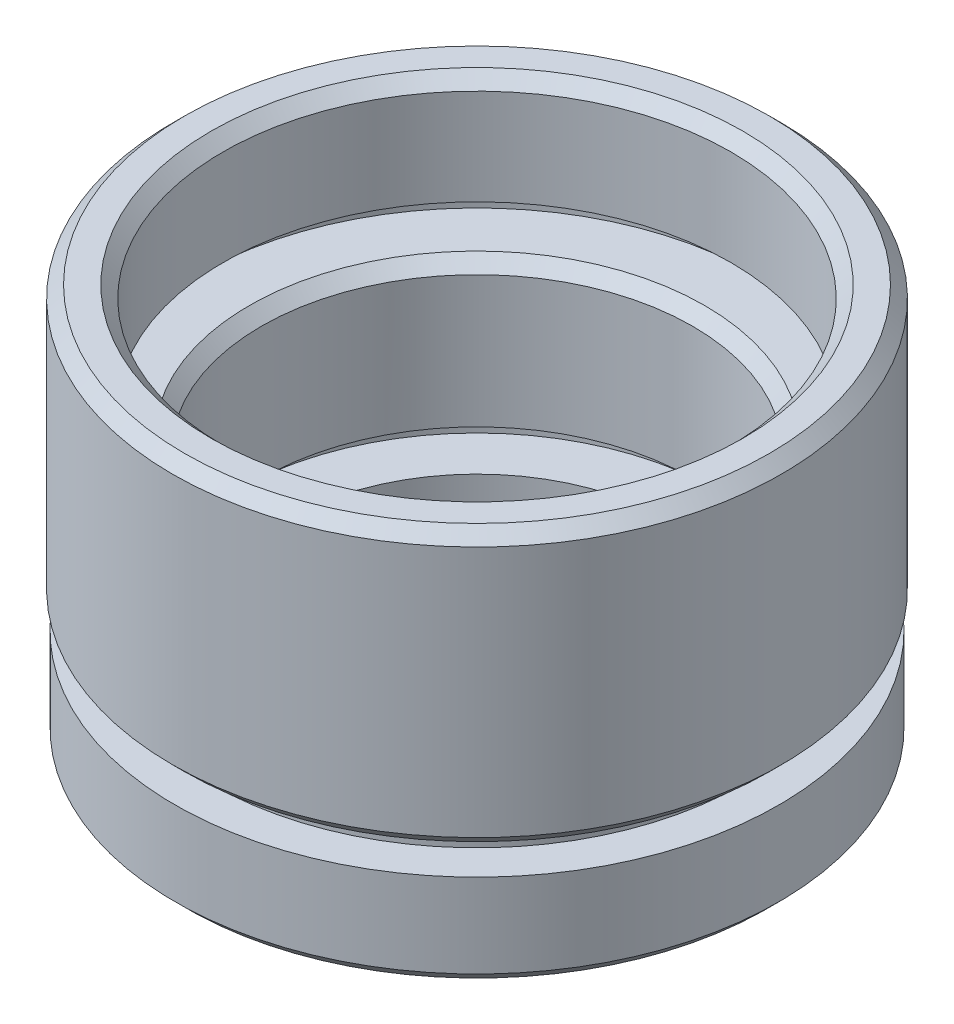
ISO-10303-21;
HEADER;
FILE_DESCRIPTION(('STEP AP214'),'2;1');
FILE_NAME('part.step','',(''),(''),'','','');
FILE_SCHEMA(('AUTOMOTIVE_DESIGN { 1 0 10303 214 1 1 1 1 }'));
ENDSEC;
DATA;
#1=APPLICATION_CONTEXT('core data for automotive mechanical design processes');
#2=APPLICATION_PROTOCOL_DEFINITION('international standard','automotive_design',2000,#1);
#3=PRODUCT_CONTEXT('',#1,'mechanical');
#4=PRODUCT('Part','Part','',(#3));
#5=PRODUCT_RELATED_PRODUCT_CATEGORY('part','',(#4));
#6=PRODUCT_DEFINITION_FORMATION('','',#4);
#7=PRODUCT_DEFINITION_CONTEXT('part definition',#1,'design');
#8=PRODUCT_DEFINITION('design','',#6,#7);
#9=PRODUCT_DEFINITION_SHAPE('','',#8);
#10=(LENGTH_UNIT() NAMED_UNIT(*) SI_UNIT(.MILLI.,.METRE.));
#11=(NAMED_UNIT(*) PLANE_ANGLE_UNIT() SI_UNIT($,.RADIAN.));
#12=(NAMED_UNIT(*) SI_UNIT($,.STERADIAN.) SOLID_ANGLE_UNIT());
#13=UNCERTAINTY_MEASURE_WITH_UNIT(LENGTH_MEASURE(1.E-05),#10,'distance_accuracy_value','');
#14=(GEOMETRIC_REPRESENTATION_CONTEXT(3) GLOBAL_UNCERTAINTY_ASSIGNED_CONTEXT((#13)) GLOBAL_UNIT_ASSIGNED_CONTEXT((#10,
#11,#12)) REPRESENTATION_CONTEXT('',''));
#15=CARTESIAN_POINT('',(0.,0.,0.));
#16=DIRECTION('',(0.,0.,1.));
#17=DIRECTION('',(1.,0.,0.));
#18=AXIS2_PLACEMENT_3D('',#15,#16,#17);
#19=CARTESIAN_POINT('',(10.6,16.5,0.));
#20=DIRECTION('',(0.,1.,0.));
#21=DIRECTION('',(0.,0.,1.));
#22=AXIS2_PLACEMENT_3D('',#19,#20,#21);
#23=PLANE('',#22);
#24=CARTESIAN_POINT('',(0.,16.5,0.));
#25=DIRECTION('',(0.,1.,0.));
#26=DIRECTION('',(0.,0.,1.));
#27=AXIS2_PLACEMENT_3D('',#24,#25,#26);
#28=CIRCLE('',#27,11.1);
#29=CARTESIAN_POINT('',(0.,16.5,11.1));
#30=VERTEX_POINT('',#29);
#31=EDGE_CURVE('E42',#30,#30,#28,.F.);
#32=ORIENTED_EDGE('',*,*,#31,.T.);
#33=EDGE_LOOP('',(#32));
#34=FACE_BOUND('',#33,.T.);
#35=CARTESIAN_POINT('',(0.,16.5,0.));
#36=DIRECTION('',(0.,-1.,0.));
#37=DIRECTION('',(0.,0.,-1.));
#38=AXIS2_PLACEMENT_3D('',#35,#36,#37);
#39=CIRCLE('',#38,12.2);
#40=CARTESIAN_POINT('',(0.,16.5,-12.2));
#41=VERTEX_POINT('',#40);
#42=EDGE_CURVE('E109',#41,#41,#39,.T.);
#43=ORIENTED_EDGE('',*,*,#42,.F.);
#44=EDGE_LOOP('',(#43));
#45=FACE_BOUND('',#44,.T.);
#46=ADVANCED_FACE('F35',(#34,#45),#23,.T.);
#47=CARTESIAN_POINT('',(0.,0.,0.));
#48=DIRECTION('',(0.,-1.,0.));
#49=DIRECTION('',(0.,0.,-1.));
#50=AXIS2_PLACEMENT_3D('',#47,#48,#49);
#51=CYLINDRICAL_SURFACE('',#50,10.6);
#52=CARTESIAN_POINT('',(0.,16.,0.));
#53=DIRECTION('',(0.,1.,0.));
#54=DIRECTION('',(0.,0.,1.));
#55=AXIS2_PLACEMENT_3D('',#52,#53,#54);
#56=CIRCLE('',#55,10.6);
#57=CARTESIAN_POINT('',(0.,16.,10.6));
#58=VERTEX_POINT('',#57);
#59=EDGE_CURVE('E10',#58,#58,#56,.T.);
#60=ORIENTED_EDGE('',*,*,#59,.T.);
#61=EDGE_LOOP('',(#60));
#62=FACE_BOUND('',#61,.T.);
#63=CARTESIAN_POINT('',(0.,12.,0.));
#64=DIRECTION('',(0.,-1.,0.));
#65=DIRECTION('',(0.,0.,-1.));
#66=AXIS2_PLACEMENT_3D('',#63,#64,#65);
#67=CIRCLE('',#66,10.6);
#68=CARTESIAN_POINT('',(0.,12.,-10.6));
#69=VERTEX_POINT('',#68);
#70=EDGE_CURVE('E55',#69,#69,#67,.T.);
#71=ORIENTED_EDGE('',*,*,#70,.T.);
#72=EDGE_LOOP('',(#71));
#73=FACE_BOUND('',#72,.T.);
#74=ADVANCED_FACE('F117',(#62,#73),#51,.F.);
#75=CARTESIAN_POINT('',(11.7,12.,0.));
#76=DIRECTION('',(0.,-1.,0.));
#77=DIRECTION('',(0.,0.,-1.));
#78=AXIS2_PLACEMENT_3D('',#75,#76,#77);
#79=PLANE('',#78);
#80=CARTESIAN_POINT('',(0.,12.,0.));
#81=DIRECTION('',(0.,-1.,0.));
#82=DIRECTION('',(0.,0.,-1.));
#83=AXIS2_PLACEMENT_3D('',#80,#81,#82);
#84=CIRCLE('',#83,11.7);
#85=CARTESIAN_POINT('',(0.,12.,-11.7));
#86=VERTEX_POINT('',#85);
#87=EDGE_CURVE('E58',#86,#86,#84,.T.);
#88=ORIENTED_EDGE('',*,*,#87,.T.);
#89=EDGE_LOOP('',(#88));
#90=FACE_BOUND('',#89,.T.);
#91=ORIENTED_EDGE('',*,*,#70,.F.);
#92=EDGE_LOOP('',(#91));
#93=FACE_BOUND('',#92,.T.);
#94=ADVANCED_FACE('F122',(#90,#93),#79,.T.);
#95=CARTESIAN_POINT('',(0.,0.,0.));
#96=DIRECTION('',(0.,-1.,0.));
#97=DIRECTION('',(0.,0.,-1.));
#98=AXIS2_PLACEMENT_3D('',#95,#96,#97);
#99=CYLINDRICAL_SURFACE('',#98,11.7);
#100=CARTESIAN_POINT('',(0.,11.,0.));
#101=DIRECTION('',(0.,-1.,0.));
#102=DIRECTION('',(0.,0.,-1.));
#103=AXIS2_PLACEMENT_3D('',#100,#101,#102);
#104=CIRCLE('',#103,11.7);
#105=CARTESIAN_POINT('',(0.,11.,-11.7));
#106=VERTEX_POINT('',#105);
#107=EDGE_CURVE('E61',#106,#106,#104,.T.);
#108=ORIENTED_EDGE('',*,*,#107,.T.);
#109=EDGE_LOOP('',(#108));
#110=FACE_BOUND('',#109,.T.);
#111=ORIENTED_EDGE('',*,*,#87,.F.);
#112=EDGE_LOOP('',(#111));
#113=FACE_BOUND('',#112,.T.);
#114=ADVANCED_FACE('F143',(#110,#113),#99,.F.);
#115=CARTESIAN_POINT('',(9.,11.,0.));
#116=DIRECTION('',(0.,1.,0.));
#117=DIRECTION('',(0.,0.,1.));
#118=AXIS2_PLACEMENT_3D('',#115,#116,#117);
#119=PLANE('',#118);
#120=CARTESIAN_POINT('',(0.,11.,0.));
#121=DIRECTION('',(0.,1.,0.));
#122=DIRECTION('',(0.,0.,1.));
#123=AXIS2_PLACEMENT_3D('',#120,#121,#122);
#124=CIRCLE('',#123,9.49999999999999);
#125=CARTESIAN_POINT('',(0.,11.,9.49999999999999));
#126=VERTEX_POINT('',#125);
#127=EDGE_CURVE('E50',#126,#126,#124,.F.);
#128=ORIENTED_EDGE('',*,*,#127,.T.);
#129=EDGE_LOOP('',(#128));
#130=FACE_BOUND('',#129,.T.);
#131=ORIENTED_EDGE('',*,*,#107,.F.);
#132=EDGE_LOOP('',(#131));
#133=FACE_BOUND('',#132,.T.);
#134=ADVANCED_FACE('F139',(#130,#133),#119,.T.);
#135=CARTESIAN_POINT('',(0.,0.,0.));
#136=DIRECTION('',(0.,-1.,0.));
#137=DIRECTION('',(0.,0.,-1.));
#138=AXIS2_PLACEMENT_3D('',#135,#136,#137);
#139=CYLINDRICAL_SURFACE('',#138,9.);
#140=CARTESIAN_POINT('',(0.,10.5,0.));
#141=DIRECTION('',(0.,1.,0.));
#142=DIRECTION('',(0.,0.,1.));
#143=AXIS2_PLACEMENT_3D('',#140,#141,#142);
#144=CIRCLE('',#143,9.);
#145=CARTESIAN_POINT('',(0.,10.5,9.));
#146=VERTEX_POINT('',#145);
#147=EDGE_CURVE('E46',#146,#146,#144,.T.);
#148=ORIENTED_EDGE('',*,*,#147,.T.);
#149=EDGE_LOOP('',(#148));
#150=FACE_BOUND('',#149,.T.);
#151=CARTESIAN_POINT('',(0.,5.,0.));
#152=DIRECTION('',(0.,-1.,0.));
#153=DIRECTION('',(0.,0.,-1.));
#154=AXIS2_PLACEMENT_3D('',#151,#152,#153);
#155=CIRCLE('',#154,9.);
#156=CARTESIAN_POINT('',(0.,5.,-9.));
#157=VERTEX_POINT('',#156);
#158=EDGE_CURVE('E64',#157,#157,#155,.T.);
#159=ORIENTED_EDGE('',*,*,#158,.T.);
#160=EDGE_LOOP('',(#159));
#161=FACE_BOUND('',#160,.T.);
#162=ADVANCED_FACE('F142',(#150,#161),#139,.F.);
#163=CARTESIAN_POINT('',(10.1,5.,0.));
#164=DIRECTION('',(0.,-1.,0.));
#165=DIRECTION('',(0.,0.,-1.));
#166=AXIS2_PLACEMENT_3D('',#163,#164,#165);
#167=PLANE('',#166);
#168=CARTESIAN_POINT('',(0.,5.,0.));
#169=DIRECTION('',(0.,-1.,0.));
#170=DIRECTION('',(0.,0.,-1.));
#171=AXIS2_PLACEMENT_3D('',#168,#169,#170);
#172=CIRCLE('',#171,10.1);
#173=CARTESIAN_POINT('',(0.,5.,-10.1));
#174=VERTEX_POINT('',#173);
#175=EDGE_CURVE('E67',#174,#174,#172,.T.);
#176=ORIENTED_EDGE('',*,*,#175,.T.);
#177=EDGE_LOOP('',(#176));
#178=FACE_BOUND('',#177,.T.);
#179=ORIENTED_EDGE('',*,*,#158,.F.);
#180=EDGE_LOOP('',(#179));
#181=FACE_BOUND('',#180,.T.);
#182=ADVANCED_FACE('F161',(#178,#181),#167,.T.);
#183=CARTESIAN_POINT('',(0.,0.,0.));
#184=DIRECTION('',(0.,-1.,0.));
#185=DIRECTION('',(0.,0.,-1.));
#186=AXIS2_PLACEMENT_3D('',#183,#184,#185);
#187=CYLINDRICAL_SURFACE('',#186,10.1);
#188=CARTESIAN_POINT('',(0.,4.,0.));
#189=DIRECTION('',(0.,-1.,0.));
#190=DIRECTION('',(0.,0.,-1.));
#191=AXIS2_PLACEMENT_3D('',#188,#189,#190);
#192=CIRCLE('',#191,10.1);
#193=CARTESIAN_POINT('',(0.,4.,-10.1));
#194=VERTEX_POINT('',#193);
#195=EDGE_CURVE('E70',#194,#194,#192,.T.);
#196=ORIENTED_EDGE('',*,*,#195,.T.);
#197=EDGE_LOOP('',(#196));
#198=FACE_BOUND('',#197,.T.);
#199=ORIENTED_EDGE('',*,*,#175,.F.);
#200=EDGE_LOOP('',(#199));
#201=FACE_BOUND('',#200,.T.);
#202=ADVANCED_FACE('F165',(#198,#201),#187,.F.);
#203=CARTESIAN_POINT('',(8.,4.,0.));
#204=DIRECTION('',(0.,1.,0.));
#205=DIRECTION('',(0.,0.,1.));
#206=AXIS2_PLACEMENT_3D('',#203,#204,#205);
#207=PLANE('',#206);
#208=CARTESIAN_POINT('',(0.,4.,0.));
#209=DIRECTION('',(0.,-1.,0.));
#210=DIRECTION('',(0.,0.,-1.));
#211=AXIS2_PLACEMENT_3D('',#208,#209,#210);
#212=CIRCLE('',#211,8.);
#213=CARTESIAN_POINT('',(0.,4.,-8.));
#214=VERTEX_POINT('',#213);
#215=EDGE_CURVE('E73',#214,#214,#212,.T.);
#216=ORIENTED_EDGE('',*,*,#215,.T.);
#217=EDGE_LOOP('',(#216));
#218=FACE_BOUND('',#217,.T.);
#219=ORIENTED_EDGE('',*,*,#195,.F.);
#220=EDGE_LOOP('',(#219));
#221=FACE_BOUND('',#220,.T.);
#222=ADVANCED_FACE('F169',(#218,#221),#207,.T.);
#223=CARTESIAN_POINT('',(0.,0.,0.));
#224=DIRECTION('',(0.,-1.,0.));
#225=DIRECTION('',(0.,0.,-1.));
#226=AXIS2_PLACEMENT_3D('',#223,#224,#225);
#227=CYLINDRICAL_SURFACE('',#226,8.);
#228=CARTESIAN_POINT('',(0.,2.,0.));
#229=DIRECTION('',(0.,-1.,0.));
#230=DIRECTION('',(0.,0.,-1.));
#231=AXIS2_PLACEMENT_3D('',#228,#229,#230);
#232=CIRCLE('',#231,8.);
#233=CARTESIAN_POINT('',(0.,2.,-8.));
#234=VERTEX_POINT('',#233);
#235=EDGE_CURVE('E76',#234,#234,#232,.T.);
#236=ORIENTED_EDGE('',*,*,#235,.T.);
#237=EDGE_LOOP('',(#236));
#238=FACE_BOUND('',#237,.T.);
#239=ORIENTED_EDGE('',*,*,#215,.F.);
#240=EDGE_LOOP('',(#239));
#241=FACE_BOUND('',#240,.T.);
#242=ADVANCED_FACE('F173',(#238,#241),#227,.F.);
#243=CARTESIAN_POINT('',(7.25,2.,0.));
#244=DIRECTION('',(0.,1.,0.));
#245=DIRECTION('',(0.,0.,1.));
#246=AXIS2_PLACEMENT_3D('',#243,#244,#245);
#247=PLANE('',#246);
#248=CARTESIAN_POINT('',(0.,2.,0.));
#249=DIRECTION('',(0.,-1.,0.));
#250=DIRECTION('',(0.,0.,-1.));
#251=AXIS2_PLACEMENT_3D('',#248,#249,#250);
#252=CIRCLE('',#251,7.25);
#253=CARTESIAN_POINT('',(0.,2.,-7.25));
#254=VERTEX_POINT('',#253);
#255=EDGE_CURVE('E79',#254,#254,#252,.T.);
#256=ORIENTED_EDGE('',*,*,#255,.T.);
#257=EDGE_LOOP('',(#256));
#258=FACE_BOUND('',#257,.T.);
#259=ORIENTED_EDGE('',*,*,#235,.F.);
#260=EDGE_LOOP('',(#259));
#261=FACE_BOUND('',#260,.T.);
#262=ADVANCED_FACE('F177',(#258,#261),#247,.T.);
#263=CARTESIAN_POINT('',(0.,0.,0.));
#264=DIRECTION('',(0.,-1.,0.));
#265=DIRECTION('',(0.,0.,-1.));
#266=AXIS2_PLACEMENT_3D('',#263,#264,#265);
#267=CYLINDRICAL_SURFACE('',#266,7.25);
#268=CARTESIAN_POINT('',(0.,0.,0.));
#269=DIRECTION('',(0.,-1.,0.));
#270=DIRECTION('',(0.,0.,-1.));
#271=AXIS2_PLACEMENT_3D('',#268,#269,#270);
#272=CIRCLE('',#271,7.25);
#273=CARTESIAN_POINT('',(0.,0.,-7.25));
#274=VERTEX_POINT('',#273);
#275=EDGE_CURVE('E82',#274,#274,#272,.T.);
#276=ORIENTED_EDGE('',*,*,#275,.T.);
#277=EDGE_LOOP('',(#276));
#278=FACE_BOUND('',#277,.T.);
#279=ORIENTED_EDGE('',*,*,#255,.F.);
#280=EDGE_LOOP('',(#279));
#281=FACE_BOUND('',#280,.T.);
#282=ADVANCED_FACE('F181',(#278,#281),#267,.F.);
#283=CARTESIAN_POINT('',(7.25,0.,0.));
#284=DIRECTION('',(0.,-1.,0.));
#285=DIRECTION('',(0.,0.,-1.));
#286=AXIS2_PLACEMENT_3D('',#283,#284,#285);
#287=PLANE('',#286);
#288=CARTESIAN_POINT('',(0.,0.,0.));
#289=DIRECTION('',(0.,-1.,0.));
#290=DIRECTION('',(0.,0.,-1.));
#291=AXIS2_PLACEMENT_3D('',#288,#289,#290);
#292=CIRCLE('',#291,12.1);
#293=CARTESIAN_POINT('',(0.,0.,-12.1));
#294=VERTEX_POINT('',#293);
#295=EDGE_CURVE('E85',#294,#294,#292,.T.);
#296=ORIENTED_EDGE('',*,*,#295,.T.);
#297=EDGE_LOOP('',(#296));
#298=FACE_BOUND('',#297,.T.);
#299=ORIENTED_EDGE('',*,*,#275,.F.);
#300=EDGE_LOOP('',(#299));
#301=FACE_BOUND('',#300,.T.);
#302=ADVANCED_FACE('F185',(#298,#301),#287,.T.);
#303=CARTESIAN_POINT('',(0.,0.,0.));
#304=DIRECTION('',(0.,1.,0.));
#305=DIRECTION('',(0.,0.,1.));
#306=AXIS2_PLACEMENT_3D('',#303,#304,#305);
#307=CONICAL_SURFACE('',#306,12.1,0.785398163397451);
#308=CARTESIAN_POINT('',(0.,0.499999999999998,0.));
#309=DIRECTION('',(0.,-1.,0.));
#310=DIRECTION('',(0.,0.,-1.));
#311=AXIS2_PLACEMENT_3D('',#308,#309,#310);
#312=CIRCLE('',#311,12.6);
#313=CARTESIAN_POINT('',(0.,0.499999999999998,-12.6));
#314=VERTEX_POINT('',#313);
#315=EDGE_CURVE('E88',#314,#314,#312,.T.);
#316=ORIENTED_EDGE('',*,*,#315,.T.);
#317=EDGE_LOOP('',(#316));
#318=FACE_BOUND('',#317,.T.);
#319=ORIENTED_EDGE('',*,*,#295,.F.);
#320=EDGE_LOOP('',(#319));
#321=FACE_BOUND('',#320,.T.);
#322=ADVANCED_FACE('F189',(#318,#321),#307,.T.);
#323=CARTESIAN_POINT('',(0.,0.,0.));
#324=DIRECTION('',(0.,-1.,0.));
#325=DIRECTION('',(0.,0.,-1.));
#326=AXIS2_PLACEMENT_3D('',#323,#324,#325);
#327=CYLINDRICAL_SURFACE('',#326,12.6);
#328=CARTESIAN_POINT('',(0.,4.,0.));
#329=DIRECTION('',(0.,-1.,0.));
#330=DIRECTION('',(0.,0.,-1.));
#331=AXIS2_PLACEMENT_3D('',#328,#329,#330);
#332=CIRCLE('',#331,12.6);
#333=CARTESIAN_POINT('',(0.,4.,-12.6));
#334=VERTEX_POINT('',#333);
#335=EDGE_CURVE('E91',#334,#334,#332,.T.);
#336=ORIENTED_EDGE('',*,*,#335,.T.);
#337=EDGE_LOOP('',(#336));
#338=FACE_BOUND('',#337,.T.);
#339=ORIENTED_EDGE('',*,*,#315,.F.);
#340=EDGE_LOOP('',(#339));
#341=FACE_BOUND('',#340,.T.);
#342=ADVANCED_FACE('F193',(#338,#341),#327,.T.);
#343=CARTESIAN_POINT('',(12.6,4.,0.));
#344=DIRECTION('',(0.,1.,0.));
#345=DIRECTION('',(0.,0.,1.));
#346=AXIS2_PLACEMENT_3D('',#343,#344,#345);
#347=PLANE('',#346);
#348=CARTESIAN_POINT('',(0.,4.,0.));
#349=DIRECTION('',(0.,-1.,0.));
#350=DIRECTION('',(0.,0.,-1.));
#351=AXIS2_PLACEMENT_3D('',#348,#349,#350);
#352=CIRCLE('',#351,11.1);
#353=CARTESIAN_POINT('',(0.,4.,-11.1));
#354=VERTEX_POINT('',#353);
#355=EDGE_CURVE('E94',#354,#354,#352,.T.);
#356=ORIENTED_EDGE('',*,*,#355,.T.);
#357=EDGE_LOOP('',(#356));
#358=FACE_BOUND('',#357,.T.);
#359=ORIENTED_EDGE('',*,*,#335,.F.);
#360=EDGE_LOOP('',(#359));
#361=FACE_BOUND('',#360,.T.);
#362=ADVANCED_FACE('F197',(#358,#361),#347,.T.);
#363=CARTESIAN_POINT('',(0.,0.,0.));
#364=DIRECTION('',(0.,-1.,0.));
#365=DIRECTION('',(0.,0.,-1.));
#366=AXIS2_PLACEMENT_3D('',#363,#364,#365);
#367=CYLINDRICAL_SURFACE('',#366,11.1);
#368=CARTESIAN_POINT('',(0.,5.,0.));
#369=DIRECTION('',(0.,-1.,0.));
#370=DIRECTION('',(0.,0.,-1.));
#371=AXIS2_PLACEMENT_3D('',#368,#369,#370);
#372=CIRCLE('',#371,11.1);
#373=CARTESIAN_POINT('',(0.,5.,-11.1));
#374=VERTEX_POINT('',#373);
#375=EDGE_CURVE('E97',#374,#374,#372,.T.);
#376=ORIENTED_EDGE('',*,*,#375,.T.);
#377=EDGE_LOOP('',(#376));
#378=FACE_BOUND('',#377,.T.);
#379=ORIENTED_EDGE('',*,*,#355,.F.);
#380=EDGE_LOOP('',(#379));
#381=FACE_BOUND('',#380,.T.);
#382=ADVANCED_FACE('F201',(#378,#381),#367,.T.);
#383=CARTESIAN_POINT('',(11.1,5.,0.));
#384=DIRECTION('',(0.,-1.,0.));
#385=DIRECTION('',(0.,0.,-1.));
#386=AXIS2_PLACEMENT_3D('',#383,#384,#385);
#387=PLANE('',#386);
#388=CARTESIAN_POINT('',(0.,5.,0.));
#389=DIRECTION('',(0.,-1.,0.));
#390=DIRECTION('',(0.,0.,-1.));
#391=AXIS2_PLACEMENT_3D('',#388,#389,#390);
#392=CIRCLE('',#391,12.2);
#393=CARTESIAN_POINT('',(0.,5.,-12.2));
#394=VERTEX_POINT('',#393);
#395=EDGE_CURVE('E100',#394,#394,#392,.T.);
#396=ORIENTED_EDGE('',*,*,#395,.T.);
#397=EDGE_LOOP('',(#396));
#398=FACE_BOUND('',#397,.T.);
#399=ORIENTED_EDGE('',*,*,#375,.F.);
#400=EDGE_LOOP('',(#399));
#401=FACE_BOUND('',#400,.T.);
#402=ADVANCED_FACE('F205',(#398,#401),#387,.T.);
#403=CARTESIAN_POINT('',(0.,5.,0.));
#404=DIRECTION('',(0.,1.,0.));
#405=DIRECTION('',(0.,0.,1.));
#406=AXIS2_PLACEMENT_3D('',#403,#404,#405);
#407=CONICAL_SURFACE('',#406,12.2,0.785398163397451);
#408=CARTESIAN_POINT('',(0.,5.5,0.));
#409=DIRECTION('',(0.,-1.,0.));
#410=DIRECTION('',(0.,0.,-1.));
#411=AXIS2_PLACEMENT_3D('',#408,#409,#410);
#412=CIRCLE('',#411,12.7);
#413=CARTESIAN_POINT('',(0.,5.5,-12.7));
#414=VERTEX_POINT('',#413);
#415=EDGE_CURVE('E103',#414,#414,#412,.T.);
#416=ORIENTED_EDGE('',*,*,#415,.T.);
#417=EDGE_LOOP('',(#416));
#418=FACE_BOUND('',#417,.T.);
#419=ORIENTED_EDGE('',*,*,#395,.F.);
#420=EDGE_LOOP('',(#419));
#421=FACE_BOUND('',#420,.T.);
#422=ADVANCED_FACE('F209',(#418,#421),#407,.T.);
#423=CARTESIAN_POINT('',(0.,0.,0.));
#424=DIRECTION('',(0.,-1.,0.));
#425=DIRECTION('',(0.,0.,-1.));
#426=AXIS2_PLACEMENT_3D('',#423,#424,#425);
#427=CYLINDRICAL_SURFACE('',#426,12.7);
#428=CARTESIAN_POINT('',(0.,16.,0.));
#429=DIRECTION('',(0.,-1.,0.));
#430=DIRECTION('',(0.,0.,-1.));
#431=AXIS2_PLACEMENT_3D('',#428,#429,#430);
#432=CIRCLE('',#431,12.7);
#433=CARTESIAN_POINT('',(0.,16.,-12.7));
#434=VERTEX_POINT('',#433);
#435=EDGE_CURVE('E106',#434,#434,#432,.T.);
#436=ORIENTED_EDGE('',*,*,#435,.T.);
#437=EDGE_LOOP('',(#436));
#438=FACE_BOUND('',#437,.T.);
#439=ORIENTED_EDGE('',*,*,#415,.F.);
#440=EDGE_LOOP('',(#439));
#441=FACE_BOUND('',#440,.T.);
#442=ADVANCED_FACE('F133',(#438,#441),#427,.T.);
#443=CARTESIAN_POINT('',(0.,16.,0.));
#444=DIRECTION('',(0.,-1.,0.));
#445=DIRECTION('',(0.,0.,-1.));
#446=AXIS2_PLACEMENT_3D('',#443,#444,#445);
#447=CONICAL_SURFACE('',#446,12.7,0.785398163397445);
#448=ORIENTED_EDGE('',*,*,#42,.T.);
#449=EDGE_LOOP('',(#448));
#450=FACE_BOUND('',#449,.T.);
#451=ORIENTED_EDGE('',*,*,#435,.F.);
#452=EDGE_LOOP('',(#451));
#453=FACE_BOUND('',#452,.T.);
#454=ADVANCED_FACE('F113',(#450,#453),#447,.T.);
#455=CARTESIAN_POINT('',(0.,11.,0.));
#456=DIRECTION('',(0.,1.,0.));
#457=DIRECTION('',(0.,0.,1.));
#458=AXIS2_PLACEMENT_3D('',#455,#456,#457);
#459=CONICAL_SURFACE('',#458,9.49999999999999,0.785398163397448);
#460=ORIENTED_EDGE('',*,*,#147,.F.);
#461=EDGE_LOOP('',(#460));
#462=FACE_BOUND('',#461,.T.);
#463=ORIENTED_EDGE('',*,*,#127,.F.);
#464=EDGE_LOOP('',(#463));
#465=FACE_BOUND('',#464,.T.);
#466=ADVANCED_FACE('F125',(#462,#465),#459,.F.);
#467=CARTESIAN_POINT('',(0.,16.5,0.));
#468=DIRECTION('',(0.,1.,0.));
#469=DIRECTION('',(0.,0.,1.));
#470=AXIS2_PLACEMENT_3D('',#467,#468,#469);
#471=CONICAL_SURFACE('',#470,11.1,0.78539816339745);
#472=ORIENTED_EDGE('',*,*,#59,.F.);
#473=EDGE_LOOP('',(#472));
#474=FACE_BOUND('',#473,.T.);
#475=ORIENTED_EDGE('',*,*,#31,.F.);
#476=EDGE_LOOP('',(#475));
#477=FACE_BOUND('',#476,.T.);
#478=ADVANCED_FACE('F37',(#474,#477),#471,.F.);
#479=CLOSED_SHELL('',(#46,#74,#94,#114,#134,#162,#182,#202,#222,#242,#262,#282,#302,#322,#342,
#362,#382,#402,#422,#442,#454,#466,#478));
#480=MANIFOLD_SOLID_BREP('B2',#479);
#481=ADVANCED_BREP_SHAPE_REPRESENTATION('',(#18,#480),#14);
#482=SHAPE_DEFINITION_REPRESENTATION(#9,#481);
ENDSEC;
END-ISO-10303-21;
